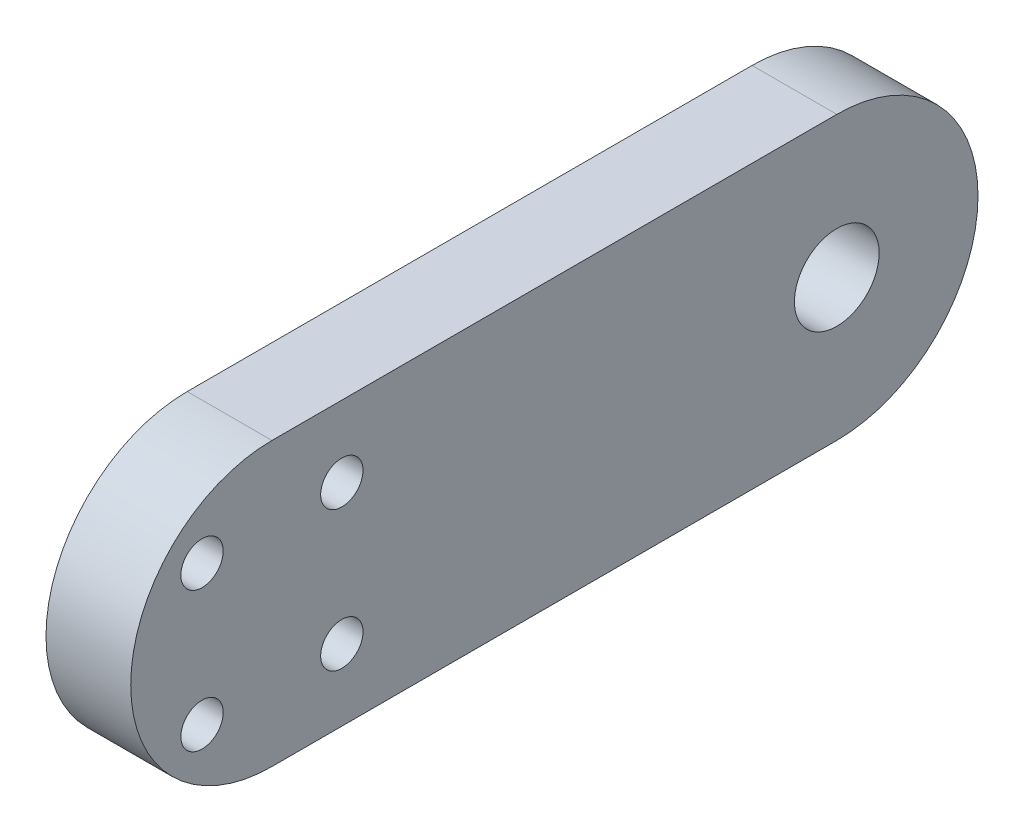
ISO-10303-21;
HEADER;
FILE_DESCRIPTION(('STEP AP214'),'2;1');
FILE_NAME('part.step','',(''),(''),'','','');
FILE_SCHEMA(('AUTOMOTIVE_DESIGN { 1 0 10303 214 1 1 1 1 }'));
ENDSEC;
DATA;
#1=APPLICATION_CONTEXT('core data for automotive mechanical design processes');
#2=APPLICATION_PROTOCOL_DEFINITION('international standard','automotive_design',2000,#1);
#3=PRODUCT_CONTEXT('',#1,'mechanical');
#4=PRODUCT('Part','Part','',(#3));
#5=PRODUCT_RELATED_PRODUCT_CATEGORY('part','',(#4));
#6=PRODUCT_DEFINITION_FORMATION('','',#4);
#7=PRODUCT_DEFINITION_CONTEXT('part definition',#1,'design');
#8=PRODUCT_DEFINITION('design','',#6,#7);
#9=PRODUCT_DEFINITION_SHAPE('','',#8);
#10=(LENGTH_UNIT() NAMED_UNIT(*) SI_UNIT(.MILLI.,.METRE.));
#11=(NAMED_UNIT(*) PLANE_ANGLE_UNIT() SI_UNIT($,.RADIAN.));
#12=(NAMED_UNIT(*) SI_UNIT($,.STERADIAN.) SOLID_ANGLE_UNIT());
#13=UNCERTAINTY_MEASURE_WITH_UNIT(LENGTH_MEASURE(1.E-05),#10,'distance_accuracy_value','');
#14=(GEOMETRIC_REPRESENTATION_CONTEXT(3) GLOBAL_UNCERTAINTY_ASSIGNED_CONTEXT((#13)) GLOBAL_UNIT_ASSIGNED_CONTEXT((#10,
#11,#12)) REPRESENTATION_CONTEXT('',''));
#15=CARTESIAN_POINT('',(0.,0.,0.));
#16=DIRECTION('',(0.,0.,1.));
#17=DIRECTION('',(1.,0.,0.));
#18=AXIS2_PLACEMENT_3D('',#15,#16,#17);
#19=CARTESIAN_POINT('',(3.,0.,-40.));
#20=DIRECTION('',(-1.,0.,0.));
#21=DIRECTION('',(0.,0.,1.));
#22=AXIS2_PLACEMENT_3D('',#19,#20,#21);
#23=CYLINDRICAL_SURFACE('',#22,10.);
#24=CARTESIAN_POINT('',(-3.,0.,-40.));
#25=DIRECTION('',(1.,0.,0.));
#26=DIRECTION('',(0.,0.,-1.));
#27=AXIS2_PLACEMENT_3D('',#24,#25,#26);
#28=CIRCLE('',#27,10.);
#29=CARTESIAN_POINT('',(-3.,-10.,-40.));
#30=VERTEX_POINT('',#29);
#31=CARTESIAN_POINT('',(-3.,10.,-40.));
#32=VERTEX_POINT('',#31);
#33=EDGE_CURVE('E104',#30,#32,#28,.T.);
#34=ORIENTED_EDGE('',*,*,#33,.T.);
#35=DIRECTION('',(-1.,0.,0.));
#36=VECTOR('',#35,1.);
#37=CARTESIAN_POINT('',(3.,10.,-40.));
#38=LINE('',#37,#36);
#39=CARTESIAN_POINT('',(3.,10.,-40.));
#40=VERTEX_POINT('',#39);
#41=EDGE_CURVE('E11',#40,#32,#38,.T.);
#42=ORIENTED_EDGE('',*,*,#41,.F.);
#43=CARTESIAN_POINT('',(3.,0.,-40.));
#44=DIRECTION('',(1.,0.,0.));
#45=DIRECTION('',(0.,0.,-1.));
#46=AXIS2_PLACEMENT_3D('',#43,#44,#45);
#47=CIRCLE('',#46,10.);
#48=CARTESIAN_POINT('',(3.,-10.,-40.));
#49=VERTEX_POINT('',#48);
#50=EDGE_CURVE('E90',#49,#40,#47,.T.);
#51=ORIENTED_EDGE('',*,*,#50,.F.);
#52=DIRECTION('',(-1.,0.,0.));
#53=VECTOR('',#52,1.);
#54=CARTESIAN_POINT('',(3.,-10.,-40.));
#55=LINE('',#54,#53);
#56=EDGE_CURVE('E57',#49,#30,#55,.T.);
#57=ORIENTED_EDGE('',*,*,#56,.T.);
#58=EDGE_LOOP('',(#34,#42,#51,#57));
#59=FACE_BOUND('',#58,.T.);
#60=ADVANCED_FACE('F41',(#59),#23,.T.);
#61=CARTESIAN_POINT('',(3.,10.,-40.));
#62=DIRECTION('',(0.,-1.,0.));
#63=DIRECTION('',(0.,0.,-1.));
#64=AXIS2_PLACEMENT_3D('',#61,#62,#63);
#65=PLANE('',#64);
#66=DIRECTION('',(0.,0.,1.));
#67=VECTOR('',#66,1.);
#68=CARTESIAN_POINT('',(-3.,10.,-40.));
#69=LINE('',#68,#67);
#70=CARTESIAN_POINT('',(-3.,9.99999999999999,0.));
#71=VERTEX_POINT('',#70);
#72=EDGE_CURVE('E95',#32,#71,#69,.T.);
#73=ORIENTED_EDGE('',*,*,#72,.T.);
#74=DIRECTION('',(-1.,0.,0.));
#75=VECTOR('',#74,1.);
#76=CARTESIAN_POINT('',(3.,9.99999999999999,0.));
#77=LINE('',#76,#75);
#78=CARTESIAN_POINT('',(3.,9.99999999999999,0.));
#79=VERTEX_POINT('',#78);
#80=EDGE_CURVE('E49',#79,#71,#77,.T.);
#81=ORIENTED_EDGE('',*,*,#80,.F.);
#82=DIRECTION('',(0.,0.,1.));
#83=VECTOR('',#82,1.);
#84=CARTESIAN_POINT('',(3.,10.,-40.));
#85=LINE('',#84,#83);
#86=EDGE_CURVE('E83',#40,#79,#85,.T.);
#87=ORIENTED_EDGE('',*,*,#86,.F.);
#88=ORIENTED_EDGE('',*,*,#41,.T.);
#89=EDGE_LOOP('',(#73,#81,#87,#88));
#90=FACE_BOUND('',#89,.T.);
#91=ADVANCED_FACE('F94',(#90),#65,.F.);
#92=CARTESIAN_POINT('',(3.,0.,0.));
#93=DIRECTION('',(-1.,0.,0.));
#94=DIRECTION('',(0.,0.,1.));
#95=AXIS2_PLACEMENT_3D('',#92,#93,#94);
#96=CYLINDRICAL_SURFACE('',#95,10.);
#97=CARTESIAN_POINT('',(-3.,0.,0.));
#98=DIRECTION('',(1.,0.,0.));
#99=DIRECTION('',(0.,0.,-1.));
#100=AXIS2_PLACEMENT_3D('',#97,#98,#99);
#101=CIRCLE('',#100,10.);
#102=CARTESIAN_POINT('',(-3.,-10.,0.));
#103=VERTEX_POINT('',#102);
#104=EDGE_CURVE('E108',#71,#103,#101,.T.);
#105=ORIENTED_EDGE('',*,*,#104,.T.);
#106=DIRECTION('',(-1.,0.,0.));
#107=VECTOR('',#106,1.);
#108=CARTESIAN_POINT('',(3.,-10.,0.));
#109=LINE('',#108,#107);
#110=CARTESIAN_POINT('',(3.,-10.,0.));
#111=VERTEX_POINT('',#110);
#112=EDGE_CURVE('E72',#111,#103,#109,.T.);
#113=ORIENTED_EDGE('',*,*,#112,.F.);
#114=CARTESIAN_POINT('',(3.,0.,0.));
#115=DIRECTION('',(1.,0.,0.));
#116=DIRECTION('',(0.,0.,-1.));
#117=AXIS2_PLACEMENT_3D('',#114,#115,#116);
#118=CIRCLE('',#117,10.);
#119=EDGE_CURVE('E89',#79,#111,#118,.T.);
#120=ORIENTED_EDGE('',*,*,#119,.F.);
#121=ORIENTED_EDGE('',*,*,#80,.T.);
#122=EDGE_LOOP('',(#105,#113,#120,#121));
#123=FACE_BOUND('',#122,.T.);
#124=ADVANCED_FACE('F98',(#123),#96,.T.);
#125=CARTESIAN_POINT('',(3.,-10.,-40.));
#126=DIRECTION('',(0.,-1.,0.));
#127=DIRECTION('',(0.,0.,-1.));
#128=AXIS2_PLACEMENT_3D('',#125,#126,#127);
#129=PLANE('',#128);
#130=DIRECTION('',(0.,0.,1.));
#131=VECTOR('',#130,1.);
#132=CARTESIAN_POINT('',(-3.,-10.,-40.));
#133=LINE('',#132,#131);
#134=EDGE_CURVE('E110',#30,#103,#133,.T.);
#135=ORIENTED_EDGE('',*,*,#134,.F.);
#136=ORIENTED_EDGE('',*,*,#56,.F.);
#137=DIRECTION('',(0.,0.,1.));
#138=VECTOR('',#137,1.);
#139=CARTESIAN_POINT('',(3.,-10.,-40.));
#140=LINE('',#139,#138);
#141=EDGE_CURVE('E99',#49,#111,#140,.T.);
#142=ORIENTED_EDGE('',*,*,#141,.T.);
#143=ORIENTED_EDGE('',*,*,#112,.T.);
#144=EDGE_LOOP('',(#135,#136,#142,#143));
#145=FACE_BOUND('',#144,.T.);
#146=ADVANCED_FACE('F151',(#145),#129,.T.);
#147=CARTESIAN_POINT('',(3.,0.,-40.));
#148=DIRECTION('',(1.,0.,0.));
#149=DIRECTION('',(0.,0.,-1.));
#150=AXIS2_PLACEMENT_3D('',#147,#148,#149);
#151=PLANE('',#150);
#152=CARTESIAN_POINT('',(3.,0.,-40.));
#153=DIRECTION('',(1.,0.,0.));
#154=DIRECTION('',(0.,0.,-1.));
#155=AXIS2_PLACEMENT_3D('',#152,#153,#154);
#156=CIRCLE('',#155,3.);
#157=CARTESIAN_POINT('',(3.,0.,-43.));
#158=VERTEX_POINT('',#157);
#159=EDGE_CURVE('E142',#158,#158,#156,.T.);
#160=ORIENTED_EDGE('',*,*,#159,.F.);
#161=EDGE_LOOP('',(#160));
#162=FACE_BOUND('',#161,.T.);
#163=CARTESIAN_POINT('',(3.,4.94974746830605,4.9497474683053));
#164=DIRECTION('',(1.,0.,0.));
#165=DIRECTION('',(0.,0.,-1.));
#166=AXIS2_PLACEMENT_3D('',#163,#164,#165);
#167=CIRCLE('',#166,1.50000000000024);
#168=CARTESIAN_POINT('',(3.,4.94974746830605,3.44974746830506));
#169=VERTEX_POINT('',#168);
#170=EDGE_CURVE('E122',#169,#169,#167,.T.);
#171=ORIENTED_EDGE('',*,*,#170,.F.);
#172=EDGE_LOOP('',(#171));
#173=FACE_BOUND('',#172,.T.);
#174=CARTESIAN_POINT('',(3.,-4.94974746830562,4.94974746830558));
#175=DIRECTION('',(1.,0.,0.));
#176=DIRECTION('',(0.,0.,-1.));
#177=AXIS2_PLACEMENT_3D('',#174,#175,#176);
#178=CIRCLE('',#177,1.50000000000015);
#179=CARTESIAN_POINT('',(3.,-4.94974746830562,3.44974746830543));
#180=VERTEX_POINT('',#179);
#181=EDGE_CURVE('E130',#180,#180,#178,.T.);
#182=ORIENTED_EDGE('',*,*,#181,.F.);
#183=EDGE_LOOP('',(#182));
#184=FACE_BOUND('',#183,.T.);
#185=CARTESIAN_POINT('',(3.,-4.94974746830591,-4.94974746830608));
#186=DIRECTION('',(1.,0.,0.));
#187=DIRECTION('',(0.,0.,-1.));
#188=AXIS2_PLACEMENT_3D('',#185,#186,#187);
#189=CIRCLE('',#188,1.49999999999984);
#190=CARTESIAN_POINT('',(3.,-4.94974746830591,-6.44974746830592));
#191=VERTEX_POINT('',#190);
#192=EDGE_CURVE('E121',#191,#191,#189,.T.);
#193=ORIENTED_EDGE('',*,*,#192,.F.);
#194=EDGE_LOOP('',(#193));
#195=FACE_BOUND('',#194,.T.);
#196=CARTESIAN_POINT('',(3.,4.94974746830576,-4.94974746830637));
#197=DIRECTION('',(1.,0.,0.));
#198=DIRECTION('',(0.,0.,-1.));
#199=AXIS2_PLACEMENT_3D('',#196,#197,#198);
#200=CIRCLE('',#199,1.5);
#201=CARTESIAN_POINT('',(3.,4.94974746830576,-6.44974746830637));
#202=VERTEX_POINT('',#201);
#203=EDGE_CURVE('E118',#202,#202,#200,.T.);
#204=ORIENTED_EDGE('',*,*,#203,.F.);
#205=EDGE_LOOP('',(#204));
#206=FACE_BOUND('',#205,.T.);
#207=ORIENTED_EDGE('',*,*,#50,.T.);
#208=ORIENTED_EDGE('',*,*,#86,.T.);
#209=ORIENTED_EDGE('',*,*,#119,.T.);
#210=ORIENTED_EDGE('',*,*,#141,.F.);
#211=EDGE_LOOP('',(#207,#208,#209,#210));
#212=FACE_BOUND('',#211,.T.);
#213=ADVANCED_FACE('F86',(#162,#173,#184,#195,#206,#212),#151,.T.);
#214=CARTESIAN_POINT('',(-3.,0.,-40.));
#215=DIRECTION('',(1.,0.,0.));
#216=DIRECTION('',(0.,0.,-1.));
#217=AXIS2_PLACEMENT_3D('',#214,#215,#216);
#218=PLANE('',#217);
#219=CARTESIAN_POINT('',(-3.,0.,-40.));
#220=DIRECTION('',(1.,0.,0.));
#221=DIRECTION('',(0.,0.,-1.));
#222=AXIS2_PLACEMENT_3D('',#219,#220,#221);
#223=CIRCLE('',#222,3.);
#224=CARTESIAN_POINT('',(-3.,0.,-43.));
#225=VERTEX_POINT('',#224);
#226=EDGE_CURVE('E129',#225,#225,#223,.T.);
#227=ORIENTED_EDGE('',*,*,#226,.T.);
#228=EDGE_LOOP('',(#227));
#229=FACE_BOUND('',#228,.T.);
#230=CARTESIAN_POINT('',(-3.,4.94974746830605,4.9497474683053));
#231=DIRECTION('',(1.,0.,0.));
#232=DIRECTION('',(0.,0.,-1.));
#233=AXIS2_PLACEMENT_3D('',#230,#231,#232);
#234=CIRCLE('',#233,1.50000000000024);
#235=CARTESIAN_POINT('',(-3.,4.94974746830605,3.44974746830506));
#236=VERTEX_POINT('',#235);
#237=EDGE_CURVE('E126',#236,#236,#234,.T.);
#238=ORIENTED_EDGE('',*,*,#237,.T.);
#239=EDGE_LOOP('',(#238));
#240=FACE_BOUND('',#239,.T.);
#241=CARTESIAN_POINT('',(-3.,-4.94974746830562,4.94974746830558));
#242=DIRECTION('',(1.,0.,0.));
#243=DIRECTION('',(0.,0.,-1.));
#244=AXIS2_PLACEMENT_3D('',#241,#242,#243);
#245=CIRCLE('',#244,1.50000000000015);
#246=CARTESIAN_POINT('',(-3.,-4.94974746830562,3.44974746830543));
#247=VERTEX_POINT('',#246);
#248=EDGE_CURVE('E125',#247,#247,#245,.T.);
#249=ORIENTED_EDGE('',*,*,#248,.T.);
#250=EDGE_LOOP('',(#249));
#251=FACE_BOUND('',#250,.T.);
#252=CARTESIAN_POINT('',(-3.,-4.94974746830591,-4.94974746830608));
#253=DIRECTION('',(1.,0.,0.));
#254=DIRECTION('',(0.,0.,-1.));
#255=AXIS2_PLACEMENT_3D('',#252,#253,#254);
#256=CIRCLE('',#255,1.49999999999984);
#257=CARTESIAN_POINT('',(-3.,-4.94974746830591,-6.44974746830592));
#258=VERTEX_POINT('',#257);
#259=EDGE_CURVE('E133',#258,#258,#256,.T.);
#260=ORIENTED_EDGE('',*,*,#259,.T.);
#261=EDGE_LOOP('',(#260));
#262=FACE_BOUND('',#261,.T.);
#263=CARTESIAN_POINT('',(-3.,4.94974746830576,-4.94974746830637));
#264=DIRECTION('',(1.,0.,0.));
#265=DIRECTION('',(0.,0.,-1.));
#266=AXIS2_PLACEMENT_3D('',#263,#264,#265);
#267=CIRCLE('',#266,1.5);
#268=CARTESIAN_POINT('',(-3.,4.94974746830576,-6.44974746830637));
#269=VERTEX_POINT('',#268);
#270=EDGE_CURVE('E106',#269,#269,#267,.T.);
#271=ORIENTED_EDGE('',*,*,#270,.T.);
#272=EDGE_LOOP('',(#271));
#273=FACE_BOUND('',#272,.T.);
#274=ORIENTED_EDGE('',*,*,#33,.F.);
#275=ORIENTED_EDGE('',*,*,#134,.T.);
#276=ORIENTED_EDGE('',*,*,#104,.F.);
#277=ORIENTED_EDGE('',*,*,#72,.F.);
#278=EDGE_LOOP('',(#274,#275,#276,#277));
#279=FACE_BOUND('',#278,.T.);
#280=ADVANCED_FACE('F150',(#229,#240,#251,#262,#273,#279),#218,.F.);
#281=CARTESIAN_POINT('',(-3.,4.94974746830576,-4.94974746830637));
#282=DIRECTION('',(1.,0.,0.));
#283=DIRECTION('',(0.,0.,-1.));
#284=AXIS2_PLACEMENT_3D('',#281,#282,#283);
#285=CYLINDRICAL_SURFACE('',#284,1.5);
#286=ORIENTED_EDGE('',*,*,#270,.F.);
#287=EDGE_LOOP('',(#286));
#288=FACE_BOUND('',#287,.T.);
#289=ORIENTED_EDGE('',*,*,#203,.T.);
#290=EDGE_LOOP('',(#289));
#291=FACE_BOUND('',#290,.T.);
#292=ADVANCED_FACE('F161',(#288,#291),#285,.F.);
#293=CARTESIAN_POINT('',(-3.,-4.94974746830591,-4.94974746830608));
#294=DIRECTION('',(1.,0.,0.));
#295=DIRECTION('',(0.,0.,-1.));
#296=AXIS2_PLACEMENT_3D('',#293,#294,#295);
#297=CYLINDRICAL_SURFACE('',#296,1.49999999999984);
#298=ORIENTED_EDGE('',*,*,#259,.F.);
#299=EDGE_LOOP('',(#298));
#300=FACE_BOUND('',#299,.T.);
#301=ORIENTED_EDGE('',*,*,#192,.T.);
#302=EDGE_LOOP('',(#301));
#303=FACE_BOUND('',#302,.T.);
#304=ADVANCED_FACE('F163',(#300,#303),#297,.F.);
#305=CARTESIAN_POINT('',(-3.,-4.94974746830562,4.94974746830558));
#306=DIRECTION('',(1.,0.,0.));
#307=DIRECTION('',(0.,0.,-1.));
#308=AXIS2_PLACEMENT_3D('',#305,#306,#307);
#309=CYLINDRICAL_SURFACE('',#308,1.50000000000015);
#310=ORIENTED_EDGE('',*,*,#248,.F.);
#311=EDGE_LOOP('',(#310));
#312=FACE_BOUND('',#311,.T.);
#313=ORIENTED_EDGE('',*,*,#181,.T.);
#314=EDGE_LOOP('',(#313));
#315=FACE_BOUND('',#314,.T.);
#316=ADVANCED_FACE('F170',(#312,#315),#309,.F.);
#317=CARTESIAN_POINT('',(-3.,4.94974746830605,4.9497474683053));
#318=DIRECTION('',(1.,0.,0.));
#319=DIRECTION('',(0.,0.,-1.));
#320=AXIS2_PLACEMENT_3D('',#317,#318,#319);
#321=CYLINDRICAL_SURFACE('',#320,1.50000000000024);
#322=ORIENTED_EDGE('',*,*,#237,.F.);
#323=EDGE_LOOP('',(#322));
#324=FACE_BOUND('',#323,.T.);
#325=ORIENTED_EDGE('',*,*,#170,.T.);
#326=EDGE_LOOP('',(#325));
#327=FACE_BOUND('',#326,.T.);
#328=ADVANCED_FACE('F231',(#324,#327),#321,.F.);
#329=CARTESIAN_POINT('',(-3.,0.,-40.));
#330=DIRECTION('',(1.,0.,0.));
#331=DIRECTION('',(0.,0.,-1.));
#332=AXIS2_PLACEMENT_3D('',#329,#330,#331);
#333=CYLINDRICAL_SURFACE('',#332,3.);
#334=ORIENTED_EDGE('',*,*,#226,.F.);
#335=EDGE_LOOP('',(#334));
#336=FACE_BOUND('',#335,.T.);
#337=ORIENTED_EDGE('',*,*,#159,.T.);
#338=EDGE_LOOP('',(#337));
#339=FACE_BOUND('',#338,.T.);
#340=ADVANCED_FACE('F146',(#336,#339),#333,.F.);
#341=CLOSED_SHELL('',(#60,#91,#124,#146,#213,#280,#292,#304,#316,#328,#340));
#342=MANIFOLD_SOLID_BREP('B2',#341);
#343=ADVANCED_BREP_SHAPE_REPRESENTATION('',(#18,#342),#14);
#344=SHAPE_DEFINITION_REPRESENTATION(#9,#343);
ENDSEC;
END-ISO-10303-21;
